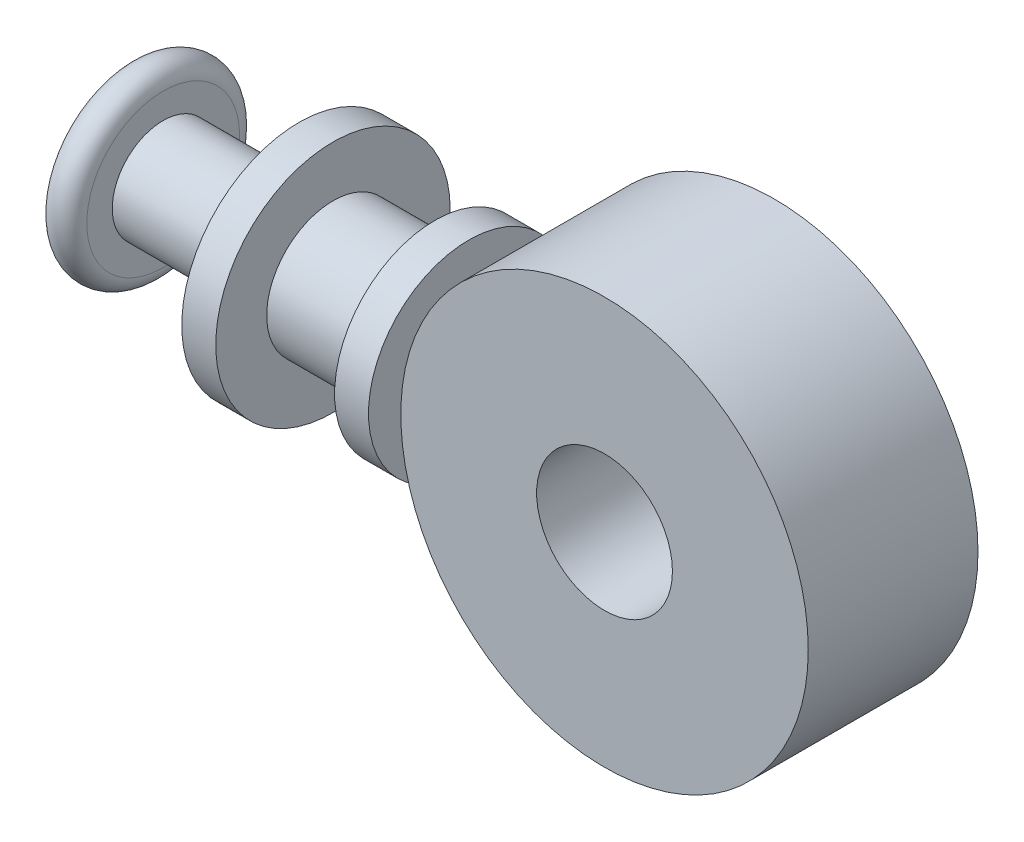
ISO-10303-21;
HEADER;
FILE_DESCRIPTION(('STEP AP214'),'2;1');
FILE_NAME('part.step','',(''),(''),'','','');
FILE_SCHEMA(('AUTOMOTIVE_DESIGN { 1 0 10303 214 1 1 1 1 }'));
ENDSEC;
DATA;
#1=APPLICATION_CONTEXT('core data for automotive mechanical design processes');
#2=APPLICATION_PROTOCOL_DEFINITION('international standard','automotive_design',2000,#1);
#3=PRODUCT_CONTEXT('',#1,'mechanical');
#4=PRODUCT('Part','Part','',(#3));
#5=PRODUCT_RELATED_PRODUCT_CATEGORY('part','',(#4));
#6=PRODUCT_DEFINITION_FORMATION('','',#4);
#7=PRODUCT_DEFINITION_CONTEXT('part definition',#1,'design');
#8=PRODUCT_DEFINITION('design','',#6,#7);
#9=PRODUCT_DEFINITION_SHAPE('','',#8);
#10=(LENGTH_UNIT() NAMED_UNIT(*) SI_UNIT(.MILLI.,.METRE.));
#11=(NAMED_UNIT(*) PLANE_ANGLE_UNIT() SI_UNIT($,.RADIAN.));
#12=(NAMED_UNIT(*) SI_UNIT($,.STERADIAN.) SOLID_ANGLE_UNIT());
#13=UNCERTAINTY_MEASURE_WITH_UNIT(LENGTH_MEASURE(1.E-05),#10,'distance_accuracy_value','');
#14=(GEOMETRIC_REPRESENTATION_CONTEXT(3) GLOBAL_UNCERTAINTY_ASSIGNED_CONTEXT((#13)) GLOBAL_UNIT_ASSIGNED_CONTEXT((#10,
#11,#12)) REPRESENTATION_CONTEXT('',''));
#15=CARTESIAN_POINT('',(0.,0.,0.));
#16=DIRECTION('',(0.,0.,1.));
#17=DIRECTION('',(1.,0.,0.));
#18=AXIS2_PLACEMENT_3D('',#15,#16,#17);
#19=CARTESIAN_POINT('',(0.,0.,-3.92049));
#20=DIRECTION('',(0.,0.,1.));
#21=DIRECTION('',(1.,0.,0.));
#22=AXIS2_PLACEMENT_3D('',#19,#20,#21);
#23=CYLINDRICAL_SURFACE('',#22,9.4107);
#24=CARTESIAN_POINT('',(-9.4107,0.,-2.35204));
#25=CARTESIAN_POINT('',(-9.41069780191557,-0.129953058002472,-2.35203635109186));
#26=CARTESIAN_POINT('',(-9.40798138381325,-0.259946884392061,-2.34123367444695));
#27=CARTESIAN_POINT('',(-9.39740827058093,-0.516208991029298,-2.29837306777573));
#28=CARTESIAN_POINT('',(-9.38954866036558,-0.642475116028954,-2.26630308361528));
#29=CARTESIAN_POINT('',(-9.36955950054807,-0.887544154290526,-2.1820010543151));
#30=CARTESIAN_POINT('',(-9.35743507853517,-1.00635582880138,-2.12979321370101));
#31=CARTESIAN_POINT('',(-9.33020759488474,-1.23353463115612,-2.00678258933218));
#32=CARTESIAN_POINT('',(-9.31510443317265,-1.34190140790823,-1.93597918080916));
#33=CARTESIAN_POINT('',(-9.28321152256702,-1.54734515419939,-1.77624772409357));
#34=CARTESIAN_POINT('',(-9.2663957640337,-1.64417648791442,-1.68700892096885));
#35=CARTESIAN_POINT('',(-9.23314572516027,-1.82166578462951,-1.49360516892714));
#36=CARTESIAN_POINT('',(-9.21671148805694,-1.90232192237442,-1.38943853778299));
#37=CARTESIAN_POINT('',(-9.1858230141254,-2.0463264006638,-1.16722896757882));
#38=CARTESIAN_POINT('',(-9.17140179713884,-2.10939999205668,-1.04900296824488));
#39=CARTESIAN_POINT('',(-9.14655147819799,-2.2146820822019,-0.803207296231911));
#40=CARTESIAN_POINT('',(-9.13612173844651,-2.25689391476401,-0.675639120221341));
#41=CARTESIAN_POINT('',(-9.12070257640185,-2.31841633758474,-0.417481170372468));
#42=CARTESIAN_POINT('',(-9.11560840146004,-2.33816856709872,-0.28700304700832));
#43=CARTESIAN_POINT('',(-9.11112359523586,-2.35558671822205,-0.0244932929212133));
#44=CARTESIAN_POINT('',(-9.11173203657741,-2.35325623098641,0.107538081719707));
#45=CARTESIAN_POINT('',(-9.11848955078623,-2.32692747479583,0.366021824776733));
#46=CARTESIAN_POINT('',(-9.12450405189732,-2.30345544771169,0.492531862967241));
#47=CARTESIAN_POINT('',(-9.14118154544497,-2.23634935553267,0.739759091051025));
#48=CARTESIAN_POINT('',(-9.15184486888005,-2.19271385477491,0.860475867781617));
#49=CARTESIAN_POINT('',(-9.17674205999671,-2.08607091792883,1.09410112750753));
#50=CARTESIAN_POINT('',(-9.19101086773618,-2.02287246763758,1.20691853829555));
#51=CARTESIAN_POINT('',(-9.2214915623509,-1.8790311988483,1.42053582400686));
#52=CARTESIAN_POINT('',(-9.2377037888498,-1.79838532932537,1.52133359227076));
#53=CARTESIAN_POINT('',(-9.27081124582875,-1.61921246365598,1.71106601633589));
#54=CARTESIAN_POINT('',(-9.28771277393849,-1.52024138189713,1.79958072945817));
#55=CARTESIAN_POINT('',(-9.31987781568212,-1.30865776990873,1.9588362558325));
#56=CARTESIAN_POINT('',(-9.33514127932665,-1.19604482358889,2.02957652674416));
#57=CARTESIAN_POINT('',(-9.36238631774591,-0.95977514946485,2.15142922143391));
#58=CARTESIAN_POINT('',(-9.37435645126133,-0.836081851790176,2.20247346089297));
#59=CARTESIAN_POINT('',(-9.39358289855824,-0.581504312561884,2.28292709157847));
#60=CARTESIAN_POINT('',(-9.4008401134978,-0.450621450920226,2.31234061895997));
#61=CARTESIAN_POINT('',(-9.40968968920342,-0.188970543265403,2.348056608709));
#62=CARTESIAN_POINT('',(-9.41142219569994,-0.0582851860506149,2.35493095443384));
#63=CARTESIAN_POINT('',(-9.40942629476124,0.202368702775377,2.34694192635996));
#64=CARTESIAN_POINT('',(-9.40569837861912,0.3323372978201,2.33208050820323));
#65=CARTESIAN_POINT('',(-9.39329031057414,0.585881279910158,2.2815131946147));
#66=CARTESIAN_POINT('',(-9.38468431730828,0.709522842736634,2.24611925863685));
#67=CARTESIAN_POINT('',(-9.36349011024486,0.949107194153072,2.1558479207135));
#68=CARTESIAN_POINT('',(-9.35090149442021,1.06504920407904,2.10096855173643));
#69=CARTESIAN_POINT('',(-9.32280280121087,1.28821878167684,1.97217563928137));
#70=CARTESIAN_POINT('',(-9.30724486624244,1.39525530572561,1.89794175167207));
#71=CARTESIAN_POINT('',(-9.27500880986743,1.59555500014741,1.73295653423382));
#72=CARTESIAN_POINT('',(-9.25833049556116,1.68881578981567,1.64220235542492));
#73=CARTESIAN_POINT('',(-9.22522901109479,1.86127311400798,1.44409759127018));
#74=CARTESIAN_POINT('',(-9.20882213704084,1.94006850534638,1.33639448518658));
#75=CARTESIAN_POINT('',(-9.17857768538886,2.07846676744174,1.10895680001856));
#76=CARTESIAN_POINT('',(-9.16473999374094,2.13807049023216,0.98922275536951));
#77=CARTESIAN_POINT('',(-9.14135308121794,2.23594987753859,0.741764003700557));
#78=CARTESIAN_POINT('',(-9.13177851987593,2.27435190369163,0.61409179770769));
#79=CARTESIAN_POINT('',(-9.11797755842036,2.32907084856933,0.353827421025838));
#80=CARTESIAN_POINT('',(-9.11374998945042,2.3453925941136,0.22123633213377));
#81=CARTESIAN_POINT('',(-9.11121072709577,2.35523556646125,-0.041020052674366));
#82=CARTESIAN_POINT('',(-9.11273267576977,2.34939793419858,-0.17066005986111));
#83=CARTESIAN_POINT('',(-9.12113635781711,2.31655513940531,-0.427044349838739));
#84=CARTESIAN_POINT('',(-9.1280179835901,2.28955040182334,-0.553788690710151));
#85=CARTESIAN_POINT('',(-9.14627294197731,2.21549003809863,-0.800087156789908));
#86=CARTESIAN_POINT('',(-9.15761932061191,2.16855460261433,-0.919679557702091));
#87=CARTESIAN_POINT('',(-9.1835291405641,2.05606030255802,-1.14937760704072));
#88=CARTESIAN_POINT('',(-9.19809302777778,1.9904988563533,-1.25948193762707));
#89=CARTESIAN_POINT('',(-9.22927133934034,1.84060326675669,-1.4701766886241));
#90=CARTESIAN_POINT('',(-9.24592932686791,1.75582423071113,-1.57044420291197));
#91=CARTESIAN_POINT('',(-9.27915874869532,1.57076707944023,-1.75553819376408));
#92=CARTESIAN_POINT('',(-9.29573016150691,1.4704852892353,-1.84036099869824));
#93=CARTESIAN_POINT('',(-9.32727715916898,1.2550787956388,-1.99365447603783));
#94=CARTESIAN_POINT('',(-9.34221843470516,1.13971830993884,-2.06180142259917));
#95=CARTESIAN_POINT('',(-9.36845973566434,0.898815586078548,-2.17762639646387));
#96=CARTESIAN_POINT('',(-9.37976236978562,0.77328072355697,-2.22531909648114));
#97=CARTESIAN_POINT('',(-9.39578122710664,0.539974640138819,-2.29179938852766));
#98=CARTESIAN_POINT('',(-9.40133734553065,0.433315061292591,-2.31434079903284));
#99=CARTESIAN_POINT('',(-9.4087975158171,0.21777975395629,-2.34446207168982));
#100=CARTESIAN_POINT('',(-9.41070184205446,0.108904192583793,-2.35204305788414));
#101=CARTESIAN_POINT('',(-9.4107,0.,-2.35204));
#102=B_SPLINE_CURVE_WITH_KNOTS('',3,(#24,#25,#26,#27,#28,#29,#30,#31,#32,#33,#34,#35,#36,#37,
#38,#39,#40,#41,#42,#43,#44,#45,#46,#47,#48,#49,#50,#51,#52,#53,#54,#55,#56,#57,#58,#59,#60,#61,
#62,#63,#64,#65,#66,#67,#68,#69,#70,#71,#72,#73,#74,#75,#76,#77,#78,#79,#80,#81,#82,#83,#84,#85,
#86,#87,#88,#89,#90,#91,#92,#93,#94,#95,#96,#97,#98,#99,#100,#101),.UNSPECIFIED.,.T.,.F.,(4,2,2,
2,2,2,2,2,2,2,2,2,2,2,2,2,2,2,2,2,2,2,2,2,2,2,2,2,2,2,2,2,2,2,2,2,2,2,4),(0.,0.389460080882369,
0.77914109340284,1.16835518432242,1.55758235361298,1.95400223245702,2.35046681930889,
2.75281773558468,3.15510433343448,3.54933573296938,3.94350302255872,4.32812211246223,
4.71276859191469,5.10129602585206,5.48989145645931,5.8895612165474,6.28924317002731,
6.69029659996452,7.09127332180278,7.48199401195589,7.87267954977732,8.25757916143491,
8.64251763930869,9.03428377303319,9.42611753226508,9.82756360510686,10.2289918528875,
10.6280010331108,11.0269229745551,11.414392022704,11.8018532922635,12.1870104636857,
12.5722210453567,12.9674752445559,13.362823284165,13.7653263792349,14.1675402565511,
14.4939429084245,14.8203210352963),.UNSPECIFIED.);
#103=CARTESIAN_POINT('',(-9.4107,0.,-2.35204));
#104=VERTEX_POINT('',#103);
#105=EDGE_CURVE('E10',#104,#104,#102,.T.);
#106=ORIENTED_EDGE('',*,*,#105,.F.);
#107=EDGE_LOOP('',(#106));
#108=FACE_BOUND('',#107,.T.);
#109=CARTESIAN_POINT('',(0.,0.,-3.92049));
#110=DIRECTION('',(0.,0.,1.));
#111=DIRECTION('',(1.,0.,0.));
#112=AXIS2_PLACEMENT_3D('',#109,#110,#111);
#113=CIRCLE('',#112,9.4107);
#114=CARTESIAN_POINT('',(9.4107,0.,-3.92049));
#115=VERTEX_POINT('',#114);
#116=EDGE_CURVE('E41',#115,#115,#113,.T.);
#117=ORIENTED_EDGE('',*,*,#116,.T.);
#118=EDGE_LOOP('',(#117));
#119=FACE_BOUND('',#118,.T.);
#120=CARTESIAN_POINT('',(0.,0.,3.92049));
#121=DIRECTION('',(0.,0.,1.));
#122=DIRECTION('',(1.,0.,0.));
#123=AXIS2_PLACEMENT_3D('',#120,#121,#122);
#124=CIRCLE('',#123,9.4107);
#125=CARTESIAN_POINT('',(9.4107,0.,3.92049));
#126=VERTEX_POINT('',#125);
#127=EDGE_CURVE('E49',#126,#126,#124,.T.);
#128=ORIENTED_EDGE('',*,*,#127,.F.);
#129=EDGE_LOOP('',(#128));
#130=FACE_BOUND('',#129,.T.);
#131=ADVANCED_FACE('F30',(#108,#119,#130),#23,.T.);
#132=CARTESIAN_POINT('',(0.,0.,-3.92049));
#133=DIRECTION('',(0.,0.,1.));
#134=DIRECTION('',(1.,0.,0.));
#135=AXIS2_PLACEMENT_3D('',#132,#133,#134);
#136=PLANE('',#135);
#137=CARTESIAN_POINT('',(0.,0.,-3.92049));
#138=DIRECTION('',(0.,0.,1.));
#139=DIRECTION('',(1.,0.,0.));
#140=AXIS2_PLACEMENT_3D('',#137,#138,#139);
#141=CIRCLE('',#140,3.1369);
#142=CARTESIAN_POINT('',(3.1369,0.,-3.92049));
#143=VERTEX_POINT('',#142);
#144=EDGE_CURVE('E45',#143,#143,#141,.T.);
#145=ORIENTED_EDGE('',*,*,#144,.T.);
#146=EDGE_LOOP('',(#145));
#147=FACE_BOUND('',#146,.T.);
#148=ORIENTED_EDGE('',*,*,#116,.F.);
#149=EDGE_LOOP('',(#148));
#150=FACE_BOUND('',#149,.T.);
#151=ADVANCED_FACE('F108',(#147,#150),#136,.F.);
#152=CARTESIAN_POINT('',(0.,0.,-3.92049));
#153=DIRECTION('',(0.,0.,1.));
#154=DIRECTION('',(1.,0.,0.));
#155=AXIS2_PLACEMENT_3D('',#152,#153,#154);
#156=CYLINDRICAL_SURFACE('',#155,3.1369);
#157=ORIENTED_EDGE('',*,*,#144,.F.);
#158=EDGE_LOOP('',(#157));
#159=FACE_BOUND('',#158,.T.);
#160=CARTESIAN_POINT('',(0.,0.,3.92049));
#161=DIRECTION('',(0.,0.,1.));
#162=DIRECTION('',(1.,0.,0.));
#163=AXIS2_PLACEMENT_3D('',#160,#161,#162);
#164=CIRCLE('',#163,3.1369);
#165=CARTESIAN_POINT('',(3.1369,0.,3.92049));
#166=VERTEX_POINT('',#165);
#167=EDGE_CURVE('E54',#166,#166,#164,.T.);
#168=ORIENTED_EDGE('',*,*,#167,.T.);
#169=EDGE_LOOP('',(#168));
#170=FACE_BOUND('',#169,.T.);
#171=ADVANCED_FACE('F104',(#159,#170),#156,.F.);
#172=CARTESIAN_POINT('',(0.,0.,3.92049));
#173=DIRECTION('',(0.,0.,1.));
#174=DIRECTION('',(1.,0.,0.));
#175=AXIS2_PLACEMENT_3D('',#172,#173,#174);
#176=PLANE('',#175);
#177=ORIENTED_EDGE('',*,*,#127,.T.);
#178=EDGE_LOOP('',(#177));
#179=FACE_BOUND('',#178,.T.);
#180=ORIENTED_EDGE('',*,*,#167,.F.);
#181=EDGE_LOOP('',(#180));
#182=FACE_BOUND('',#181,.T.);
#183=ADVANCED_FACE('F97',(#179,#182),#176,.T.);
#184=CARTESIAN_POINT('',(-25.87498,0.,0.));
#185=DIRECTION('',(-1.,0.,0.));
#186=DIRECTION('',(0.,0.,1.));
#187=AXIS2_PLACEMENT_3D('',#184,#185,#186);
#188=PLANE('',#187);
#189=CARTESIAN_POINT('',(-25.87498,0.,0.));
#190=DIRECTION('',(1.,0.,0.));
#191=DIRECTION('',(0.,0.,-1.));
#192=AXIS2_PLACEMENT_3D('',#189,#190,#191);
#193=CIRCLE('',#192,3.52933);
#194=CARTESIAN_POINT('',(-25.87498,0.,-3.52933));
#195=VERTEX_POINT('',#194);
#196=EDGE_CURVE('E87',#195,#195,#193,.T.);
#197=ORIENTED_EDGE('',*,*,#196,.F.);
#198=EDGE_LOOP('',(#197));
#199=FACE_BOUND('',#198,.T.);
#200=ADVANCED_FACE('F94',(#199),#188,.T.);
#201=CARTESIAN_POINT('',(-5.95918898373135,0.,0.));
#202=DIRECTION('',(1.,0.,0.));
#203=DIRECTION('',(0.,0.,-1.));
#204=AXIS2_PLACEMENT_3D('',#201,#202,#203);
#205=CYLINDRICAL_SURFACE('',#204,2.35204);
#206=ORIENTED_EDGE('',*,*,#105,.T.);
#207=EDGE_LOOP('',(#206));
#208=FACE_BOUND('',#207,.T.);
#209=CARTESIAN_POINT('',(-10.19302,0.,0.));
#210=DIRECTION('',(1.,0.,0.));
#211=DIRECTION('',(0.,0.,-1.));
#212=AXIS2_PLACEMENT_3D('',#209,#210,#211);
#213=CIRCLE('',#212,2.35204);
#214=CARTESIAN_POINT('',(-10.19302,0.,-2.35204));
#215=VERTEX_POINT('',#214);
#216=EDGE_CURVE('E57',#215,#215,#213,.T.);
#217=ORIENTED_EDGE('',*,*,#216,.T.);
#218=EDGE_LOOP('',(#217));
#219=FACE_BOUND('',#218,.T.);
#220=ADVANCED_FACE('F96',(#208,#219),#205,.T.);
#221=CARTESIAN_POINT('',(-10.19302,0.,-4.63042));
#222=DIRECTION('',(1.,0.,0.));
#223=DIRECTION('',(0.,0.,-1.));
#224=AXIS2_PLACEMENT_3D('',#221,#222,#223);
#225=PLANE('',#224);
#226=CARTESIAN_POINT('',(-10.19302,0.,0.));
#227=DIRECTION('',(1.,0.,0.));
#228=DIRECTION('',(0.,0.,-1.));
#229=AXIS2_PLACEMENT_3D('',#226,#227,#228);
#230=CIRCLE('',#229,4.63042);
#231=CARTESIAN_POINT('',(-10.19302,0.,-4.63042));
#232=VERTEX_POINT('',#231);
#233=EDGE_CURVE('E60',#232,#232,#230,.T.);
#234=ORIENTED_EDGE('',*,*,#233,.T.);
#235=EDGE_LOOP('',(#234));
#236=FACE_BOUND('',#235,.T.);
#237=ORIENTED_EDGE('',*,*,#216,.F.);
#238=EDGE_LOOP('',(#237));
#239=FACE_BOUND('',#238,.T.);
#240=ADVANCED_FACE('F103',(#236,#239),#225,.T.);
#241=CARTESIAN_POINT('',(-5.95918898373135,0.,0.));
#242=DIRECTION('',(1.,0.,0.));
#243=DIRECTION('',(0.,0.,-1.));
#244=AXIS2_PLACEMENT_3D('',#241,#242,#243);
#245=CYLINDRICAL_SURFACE('',#244,4.63042);
#246=CARTESIAN_POINT('',(-11.7602,0.,0.));
#247=DIRECTION('',(1.,0.,0.));
#248=DIRECTION('',(0.,0.,-1.));
#249=AXIS2_PLACEMENT_3D('',#246,#247,#248);
#250=CIRCLE('',#249,4.63042);
#251=CARTESIAN_POINT('',(-11.7602,0.,-4.63042));
#252=VERTEX_POINT('',#251);
#253=EDGE_CURVE('E63',#252,#252,#250,.T.);
#254=ORIENTED_EDGE('',*,*,#253,.T.);
#255=EDGE_LOOP('',(#254));
#256=FACE_BOUND('',#255,.T.);
#257=ORIENTED_EDGE('',*,*,#233,.F.);
#258=EDGE_LOOP('',(#257));
#259=FACE_BOUND('',#258,.T.);
#260=ADVANCED_FACE('F156',(#256,#259),#245,.T.);
#261=CARTESIAN_POINT('',(-11.7602,0.,-3.06197));
#262=DIRECTION('',(-1.,0.,0.));
#263=DIRECTION('',(0.,0.,1.));
#264=AXIS2_PLACEMENT_3D('',#261,#262,#263);
#265=PLANE('',#264);
#266=CARTESIAN_POINT('',(-11.7602,0.,0.));
#267=DIRECTION('',(1.,0.,0.));
#268=DIRECTION('',(0.,0.,-1.));
#269=AXIS2_PLACEMENT_3D('',#266,#267,#268);
#270=CIRCLE('',#269,3.06197);
#271=CARTESIAN_POINT('',(-11.7602,0.,-3.06197));
#272=VERTEX_POINT('',#271);
#273=EDGE_CURVE('E66',#272,#272,#270,.T.);
#274=ORIENTED_EDGE('',*,*,#273,.T.);
#275=EDGE_LOOP('',(#274));
#276=FACE_BOUND('',#275,.T.);
#277=ORIENTED_EDGE('',*,*,#253,.F.);
#278=EDGE_LOOP('',(#277));
#279=FACE_BOUND('',#278,.T.);
#280=ADVANCED_FACE('F166',(#276,#279),#265,.T.);
#281=CARTESIAN_POINT('',(-5.95918898373135,0.,0.));
#282=DIRECTION('',(1.,0.,0.));
#283=DIRECTION('',(0.,0.,-1.));
#284=AXIS2_PLACEMENT_3D('',#281,#282,#283);
#285=CYLINDRICAL_SURFACE('',#284,3.06197);
#286=CARTESIAN_POINT('',(-16.46428,0.,0.));
#287=DIRECTION('',(1.,0.,0.));
#288=DIRECTION('',(0.,0.,-1.));
#289=AXIS2_PLACEMENT_3D('',#286,#287,#288);
#290=CIRCLE('',#289,3.06197);
#291=CARTESIAN_POINT('',(-16.46428,0.,-3.06197));
#292=VERTEX_POINT('',#291);
#293=EDGE_CURVE('E69',#292,#292,#290,.T.);
#294=ORIENTED_EDGE('',*,*,#293,.T.);
#295=EDGE_LOOP('',(#294));
#296=FACE_BOUND('',#295,.T.);
#297=ORIENTED_EDGE('',*,*,#273,.F.);
#298=EDGE_LOOP('',(#297));
#299=FACE_BOUND('',#298,.T.);
#300=ADVANCED_FACE('F176',(#296,#299),#285,.T.);
#301=CARTESIAN_POINT('',(-16.46428,0.,-5.41528));
#302=DIRECTION('',(1.,0.,0.));
#303=DIRECTION('',(0.,0.,-1.));
#304=AXIS2_PLACEMENT_3D('',#301,#302,#303);
#305=PLANE('',#304);
#306=CARTESIAN_POINT('',(-16.46428,0.,0.));
#307=DIRECTION('',(1.,0.,0.));
#308=DIRECTION('',(0.,0.,-1.));
#309=AXIS2_PLACEMENT_3D('',#306,#307,#308);
#310=CIRCLE('',#309,5.41528);
#311=CARTESIAN_POINT('',(-16.46428,0.,-5.41528));
#312=VERTEX_POINT('',#311);
#313=EDGE_CURVE('E72',#312,#312,#310,.T.);
#314=ORIENTED_EDGE('',*,*,#313,.T.);
#315=EDGE_LOOP('',(#314));
#316=FACE_BOUND('',#315,.T.);
#317=ORIENTED_EDGE('',*,*,#293,.F.);
#318=EDGE_LOOP('',(#317));
#319=FACE_BOUND('',#318,.T.);
#320=ADVANCED_FACE('F186',(#316,#319),#305,.T.);
#321=CARTESIAN_POINT('',(-5.95918898373135,0.,0.));
#322=DIRECTION('',(1.,0.,0.));
#323=DIRECTION('',(0.,0.,-1.));
#324=AXIS2_PLACEMENT_3D('',#321,#322,#323);
#325=CYLINDRICAL_SURFACE('',#324,5.41528);
#326=CARTESIAN_POINT('',(-18.034,0.,0.));
#327=DIRECTION('',(1.,0.,0.));
#328=DIRECTION('',(0.,0.,-1.));
#329=AXIS2_PLACEMENT_3D('',#326,#327,#328);
#330=CIRCLE('',#329,5.41528);
#331=CARTESIAN_POINT('',(-18.034,0.,-5.41528));
#332=VERTEX_POINT('',#331);
#333=EDGE_CURVE('E75',#332,#332,#330,.T.);
#334=ORIENTED_EDGE('',*,*,#333,.T.);
#335=EDGE_LOOP('',(#334));
#336=FACE_BOUND('',#335,.T.);
#337=ORIENTED_EDGE('',*,*,#313,.F.);
#338=EDGE_LOOP('',(#337));
#339=FACE_BOUND('',#338,.T.);
#340=ADVANCED_FACE('F196',(#336,#339),#325,.T.);
#341=CARTESIAN_POINT('',(-18.034,0.,-2.35204));
#342=DIRECTION('',(-1.,0.,0.));
#343=DIRECTION('',(0.,0.,1.));
#344=AXIS2_PLACEMENT_3D('',#341,#342,#343);
#345=PLANE('',#344);
#346=CARTESIAN_POINT('',(-18.034,0.,0.));
#347=DIRECTION('',(1.,0.,0.));
#348=DIRECTION('',(0.,0.,-1.));
#349=AXIS2_PLACEMENT_3D('',#346,#347,#348);
#350=CIRCLE('',#349,2.35204);
#351=CARTESIAN_POINT('',(-18.034,0.,-2.35204));
#352=VERTEX_POINT('',#351);
#353=EDGE_CURVE('E78',#352,#352,#350,.T.);
#354=ORIENTED_EDGE('',*,*,#353,.T.);
#355=EDGE_LOOP('',(#354));
#356=FACE_BOUND('',#355,.T.);
#357=ORIENTED_EDGE('',*,*,#333,.F.);
#358=EDGE_LOOP('',(#357));
#359=FACE_BOUND('',#358,.T.);
#360=ADVANCED_FACE('F206',(#356,#359),#345,.T.);
#361=CARTESIAN_POINT('',(-5.95918898373135,0.,0.));
#362=DIRECTION('',(1.,0.,0.));
#363=DIRECTION('',(0.,0.,-1.));
#364=AXIS2_PLACEMENT_3D('',#361,#362,#363);
#365=CYLINDRICAL_SURFACE('',#364,2.35204);
#366=CARTESIAN_POINT('',(-24.3078,0.,0.));
#367=DIRECTION('',(1.,0.,0.));
#368=DIRECTION('',(0.,0.,-1.));
#369=AXIS2_PLACEMENT_3D('',#366,#367,#368);
#370=CIRCLE('',#369,2.35204);
#371=CARTESIAN_POINT('',(-24.3078,0.,-2.35204));
#372=VERTEX_POINT('',#371);
#373=EDGE_CURVE('E81',#372,#372,#370,.T.);
#374=ORIENTED_EDGE('',*,*,#373,.T.);
#375=EDGE_LOOP('',(#374));
#376=FACE_BOUND('',#375,.T.);
#377=ORIENTED_EDGE('',*,*,#353,.F.);
#378=EDGE_LOOP('',(#377));
#379=FACE_BOUND('',#378,.T.);
#380=ADVANCED_FACE('F216',(#376,#379),#365,.T.);
#381=CARTESIAN_POINT('',(-24.3078,0.,-3.52933));
#382=DIRECTION('',(1.,0.,0.));
#383=DIRECTION('',(0.,0.,-1.));
#384=AXIS2_PLACEMENT_3D('',#381,#382,#383);
#385=PLANE('',#384);
#386=CARTESIAN_POINT('',(-24.3078,0.,0.));
#387=DIRECTION('',(1.,0.,0.));
#388=DIRECTION('',(0.,0.,-1.));
#389=AXIS2_PLACEMENT_3D('',#386,#387,#388);
#390=CIRCLE('',#389,3.52933);
#391=CARTESIAN_POINT('',(-24.3078,0.,-3.52933));
#392=VERTEX_POINT('',#391);
#393=EDGE_CURVE('E84',#392,#392,#390,.T.);
#394=ORIENTED_EDGE('',*,*,#393,.T.);
#395=EDGE_LOOP('',(#394));
#396=FACE_BOUND('',#395,.T.);
#397=ORIENTED_EDGE('',*,*,#373,.F.);
#398=EDGE_LOOP('',(#397));
#399=FACE_BOUND('',#398,.T.);
#400=ADVANCED_FACE('F226',(#396,#399),#385,.T.);
#401=CARTESIAN_POINT('',(-25.09139,0.,0.));
#402=DIRECTION('',(1.,0.,0.));
#403=DIRECTION('',(0.,0.,-1.));
#404=AXIS2_PLACEMENT_3D('',#401,#402,#403);
#405=TOROIDAL_SURFACE('',#404,3.52933,0.783590000000001);
#406=ORIENTED_EDGE('',*,*,#196,.T.);
#407=EDGE_LOOP('',(#406));
#408=FACE_BOUND('',#407,.T.);
#409=ORIENTED_EDGE('',*,*,#393,.F.);
#410=EDGE_LOOP('',(#409));
#411=FACE_BOUND('',#410,.T.);
#412=ADVANCED_FACE('F91',(#408,#411),#405,.T.);
#413=CLOSED_SHELL('',(#131,#151,#171,#183,#200,#220,#240,#260,#280,#300,#320,#340,#360,#380,
#400,#412));
#414=MANIFOLD_SOLID_BREP('B2',#413);
#415=ADVANCED_BREP_SHAPE_REPRESENTATION('',(#18,#414),#14);
#416=SHAPE_DEFINITION_REPRESENTATION(#9,#415);
ENDSEC;
END-ISO-10303-21;
